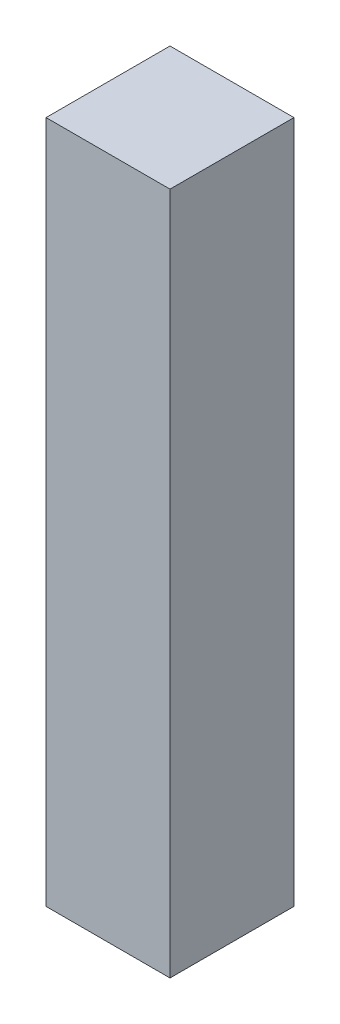
ISO-10303-21;
HEADER;
FILE_DESCRIPTION(('STEP AP214'),'2;1');
FILE_NAME('part.step','',(''),(''),'','','');
FILE_SCHEMA(('AUTOMOTIVE_DESIGN { 1 0 10303 214 1 1 1 1 }'));
ENDSEC;
DATA;
#1=APPLICATION_CONTEXT('core data for automotive mechanical design processes');
#2=APPLICATION_PROTOCOL_DEFINITION('international standard','automotive_design',2000,#1);
#3=PRODUCT_CONTEXT('',#1,'mechanical');
#4=PRODUCT('Part','Part','',(#3));
#5=PRODUCT_RELATED_PRODUCT_CATEGORY('part','',(#4));
#6=PRODUCT_DEFINITION_FORMATION('','',#4);
#7=PRODUCT_DEFINITION_CONTEXT('part definition',#1,'design');
#8=PRODUCT_DEFINITION('design','',#6,#7);
#9=PRODUCT_DEFINITION_SHAPE('','',#8);
#10=(LENGTH_UNIT() NAMED_UNIT(*) SI_UNIT(.MILLI.,.METRE.));
#11=(NAMED_UNIT(*) PLANE_ANGLE_UNIT() SI_UNIT($,.RADIAN.));
#12=(NAMED_UNIT(*) SI_UNIT($,.STERADIAN.) SOLID_ANGLE_UNIT());
#13=UNCERTAINTY_MEASURE_WITH_UNIT(LENGTH_MEASURE(1.E-05),#10,'distance_accuracy_value','');
#14=(GEOMETRIC_REPRESENTATION_CONTEXT(3) GLOBAL_UNCERTAINTY_ASSIGNED_CONTEXT((#13)) GLOBAL_UNIT_ASSIGNED_CONTEXT((#10,
#11,#12)) REPRESENTATION_CONTEXT('',''));
#15=CARTESIAN_POINT('',(0.,0.,0.));
#16=DIRECTION('',(0.,0.,1.));
#17=DIRECTION('',(1.,0.,0.));
#18=AXIS2_PLACEMENT_3D('',#15,#16,#17);
#19=CARTESIAN_POINT('',(1.27,14.,-1.27));
#20=DIRECTION('',(-1.,0.,0.));
#21=DIRECTION('',(0.,0.,1.));
#22=AXIS2_PLACEMENT_3D('',#19,#20,#21);
#23=PLANE('',#22);
#24=DIRECTION('',(0.,0.,-1.));
#25=VECTOR('',#24,1.);
#26=CARTESIAN_POINT('',(1.27,0.,-1.27));
#27=LINE('',#26,#25);
#28=CARTESIAN_POINT('',(1.27,0.,1.27));
#29=VERTEX_POINT('',#28);
#30=CARTESIAN_POINT('',(1.27,0.,-1.27));
#31=VERTEX_POINT('',#30);
#32=EDGE_CURVE('E107',#29,#31,#27,.T.);
#33=ORIENTED_EDGE('',*,*,#32,.T.);
#34=DIRECTION('',(0.,-1.,0.));
#35=VECTOR('',#34,1.);
#36=CARTESIAN_POINT('',(1.27,14.,-1.27));
#37=LINE('',#36,#35);
#38=CARTESIAN_POINT('',(1.27,14.,-1.27));
#39=VERTEX_POINT('',#38);
#40=EDGE_CURVE('E11',#39,#31,#37,.T.);
#41=ORIENTED_EDGE('',*,*,#40,.F.);
#42=DIRECTION('',(0.,0.,-1.));
#43=VECTOR('',#42,1.);
#44=CARTESIAN_POINT('',(1.27,14.,-1.27));
#45=LINE('',#44,#43);
#46=CARTESIAN_POINT('',(1.27,14.,1.27));
#47=VERTEX_POINT('',#46);
#48=EDGE_CURVE('E91',#47,#39,#45,.T.);
#49=ORIENTED_EDGE('',*,*,#48,.F.);
#50=DIRECTION('',(0.,-1.,0.));
#51=VECTOR('',#50,1.);
#52=CARTESIAN_POINT('',(1.27,14.,1.27));
#53=LINE('',#52,#51);
#54=EDGE_CURVE('E103',#47,#29,#53,.T.);
#55=ORIENTED_EDGE('',*,*,#54,.T.);
#56=EDGE_LOOP('',(#33,#41,#49,#55));
#57=FACE_BOUND('',#56,.T.);
#58=ADVANCED_FACE('F39',(#57),#23,.F.);
#59=CARTESIAN_POINT('',(-1.27,14.,-1.27));
#60=DIRECTION('',(0.,0.,1.));
#61=DIRECTION('',(1.,0.,0.));
#62=AXIS2_PLACEMENT_3D('',#59,#60,#61);
#63=PLANE('',#62);
#64=DIRECTION('',(-1.,0.,0.));
#65=VECTOR('',#64,1.);
#66=CARTESIAN_POINT('',(-1.27,0.,-1.27));
#67=LINE('',#66,#65);
#68=CARTESIAN_POINT('',(-1.27,0.,-1.27));
#69=VERTEX_POINT('',#68);
#70=EDGE_CURVE('E96',#31,#69,#67,.T.);
#71=ORIENTED_EDGE('',*,*,#70,.T.);
#72=DIRECTION('',(0.,-1.,0.));
#73=VECTOR('',#72,1.);
#74=CARTESIAN_POINT('',(-1.27,14.,-1.27));
#75=LINE('',#74,#73);
#76=CARTESIAN_POINT('',(-1.27,14.,-1.27));
#77=VERTEX_POINT('',#76);
#78=EDGE_CURVE('E48',#77,#69,#75,.T.);
#79=ORIENTED_EDGE('',*,*,#78,.F.);
#80=DIRECTION('',(-1.,0.,0.));
#81=VECTOR('',#80,1.);
#82=CARTESIAN_POINT('',(-1.27,14.,-1.27));
#83=LINE('',#82,#81);
#84=EDGE_CURVE('E86',#39,#77,#83,.T.);
#85=ORIENTED_EDGE('',*,*,#84,.F.);
#86=ORIENTED_EDGE('',*,*,#40,.T.);
#87=EDGE_LOOP('',(#71,#79,#85,#86));
#88=FACE_BOUND('',#87,.T.);
#89=ADVANCED_FACE('F95',(#88),#63,.F.);
#90=CARTESIAN_POINT('',(-1.27,14.,-1.27));
#91=DIRECTION('',(1.,0.,0.));
#92=DIRECTION('',(0.,0.,-1.));
#93=AXIS2_PLACEMENT_3D('',#90,#91,#92);
#94=PLANE('',#93);
#95=DIRECTION('',(0.,0.,1.));
#96=VECTOR('',#95,1.);
#97=CARTESIAN_POINT('',(-1.27,0.,-1.27));
#98=LINE('',#97,#96);
#99=CARTESIAN_POINT('',(-1.27,0.,1.27));
#100=VERTEX_POINT('',#99);
#101=EDGE_CURVE('E73',#69,#100,#98,.T.);
#102=ORIENTED_EDGE('',*,*,#101,.T.);
#103=DIRECTION('',(0.,-1.,0.));
#104=VECTOR('',#103,1.);
#105=CARTESIAN_POINT('',(-1.27,14.,1.27));
#106=LINE('',#105,#104);
#107=CARTESIAN_POINT('',(-1.27,14.,1.27));
#108=VERTEX_POINT('',#107);
#109=EDGE_CURVE('E98',#108,#100,#106,.T.);
#110=ORIENTED_EDGE('',*,*,#109,.F.);
#111=DIRECTION('',(0.,0.,1.));
#112=VECTOR('',#111,1.);
#113=CARTESIAN_POINT('',(-1.27,14.,-1.27));
#114=LINE('',#113,#112);
#115=EDGE_CURVE('E89',#77,#108,#114,.T.);
#116=ORIENTED_EDGE('',*,*,#115,.F.);
#117=ORIENTED_EDGE('',*,*,#78,.T.);
#118=EDGE_LOOP('',(#102,#110,#116,#117));
#119=FACE_BOUND('',#118,.T.);
#120=ADVANCED_FACE('F99',(#119),#94,.F.);
#121=CARTESIAN_POINT('',(-1.27,14.,1.27));
#122=DIRECTION('',(0.,0.,-1.));
#123=DIRECTION('',(-1.,0.,0.));
#124=AXIS2_PLACEMENT_3D('',#121,#122,#123);
#125=PLANE('',#124);
#126=DIRECTION('',(1.,0.,0.));
#127=VECTOR('',#126,1.);
#128=CARTESIAN_POINT('',(-1.27,0.,1.27));
#129=LINE('',#128,#127);
#130=EDGE_CURVE('E79',#100,#29,#129,.T.);
#131=ORIENTED_EDGE('',*,*,#130,.T.);
#132=ORIENTED_EDGE('',*,*,#54,.F.);
#133=DIRECTION('',(1.,0.,0.));
#134=VECTOR('',#133,1.);
#135=CARTESIAN_POINT('',(-1.27,14.,1.27));
#136=LINE('',#135,#134);
#137=EDGE_CURVE('E56',#108,#47,#136,.T.);
#138=ORIENTED_EDGE('',*,*,#137,.F.);
#139=ORIENTED_EDGE('',*,*,#109,.T.);
#140=EDGE_LOOP('',(#131,#132,#138,#139));
#141=FACE_BOUND('',#140,.T.);
#142=ADVANCED_FACE('F120',(#141),#125,.F.);
#143=CARTESIAN_POINT('',(0.,14.,0.));
#144=DIRECTION('',(0.,1.,0.));
#145=DIRECTION('',(0.,0.,1.));
#146=AXIS2_PLACEMENT_3D('',#143,#144,#145);
#147=PLANE('',#146);
#148=ORIENTED_EDGE('',*,*,#48,.T.);
#149=ORIENTED_EDGE('',*,*,#84,.T.);
#150=ORIENTED_EDGE('',*,*,#115,.T.);
#151=ORIENTED_EDGE('',*,*,#137,.T.);
#152=EDGE_LOOP('',(#148,#149,#150,#151));
#153=FACE_BOUND('',#152,.T.);
#154=ADVANCED_FACE('F87',(#153),#147,.T.);
#155=CARTESIAN_POINT('',(0.,0.,0.));
#156=DIRECTION('',(0.,1.,0.));
#157=DIRECTION('',(0.,0.,1.));
#158=AXIS2_PLACEMENT_3D('',#155,#156,#157);
#159=PLANE('',#158);
#160=ORIENTED_EDGE('',*,*,#32,.F.);
#161=ORIENTED_EDGE('',*,*,#130,.F.);
#162=ORIENTED_EDGE('',*,*,#101,.F.);
#163=ORIENTED_EDGE('',*,*,#70,.F.);
#164=EDGE_LOOP('',(#160,#161,#162,#163));
#165=FACE_BOUND('',#164,.T.);
#166=ADVANCED_FACE('F123',(#165),#159,.F.);
#167=CLOSED_SHELL('',(#58,#89,#120,#142,#154,#166));
#168=MANIFOLD_SOLID_BREP('B2',#167);
#169=ADVANCED_BREP_SHAPE_REPRESENTATION('',(#18,#168),#14);
#170=SHAPE_DEFINITION_REPRESENTATION(#9,#169);
ENDSEC;
END-ISO-10303-21;
